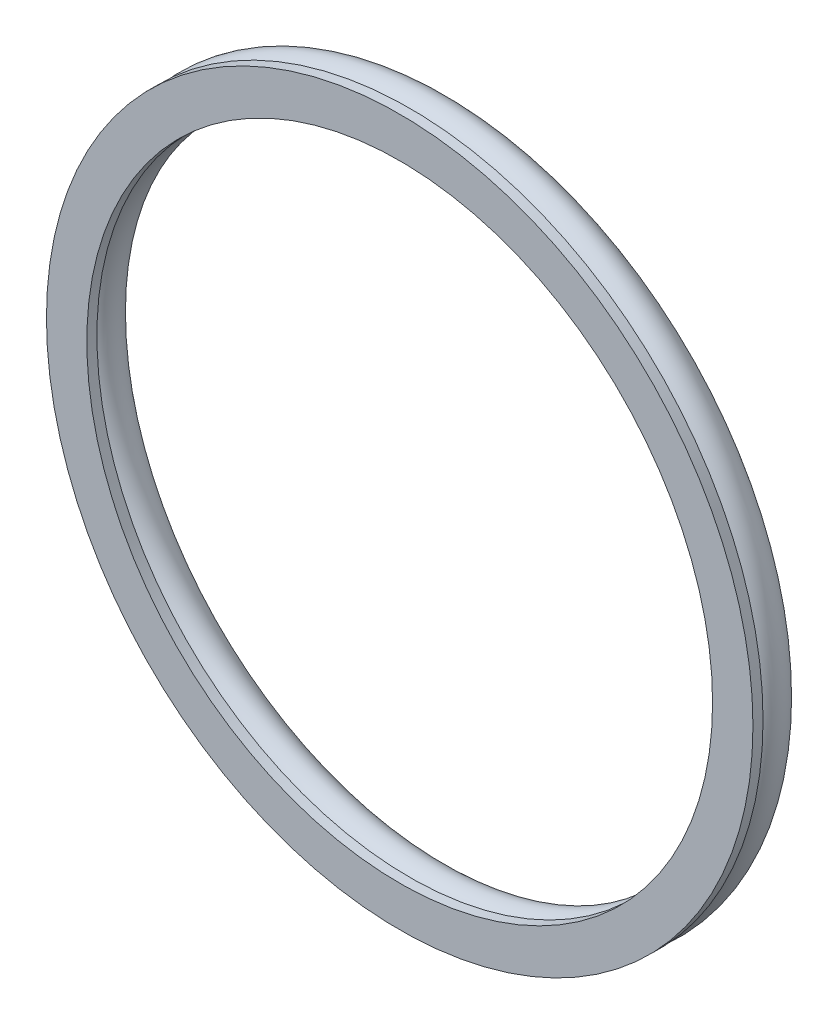
ISO-10303-21;
HEADER;
FILE_DESCRIPTION(('STEP AP214'),'2;1');
FILE_NAME('part.step','',(''),(''),'','','');
FILE_SCHEMA(('AUTOMOTIVE_DESIGN { 1 0 10303 214 1 1 1 1 }'));
ENDSEC;
DATA;
#1=APPLICATION_CONTEXT('core data for automotive mechanical design processes');
#2=APPLICATION_PROTOCOL_DEFINITION('international standard','automotive_design',2000,#1);
#3=PRODUCT_CONTEXT('',#1,'mechanical');
#4=PRODUCT('Part','Part','',(#3));
#5=PRODUCT_RELATED_PRODUCT_CATEGORY('part','',(#4));
#6=PRODUCT_DEFINITION_FORMATION('','',#4);
#7=PRODUCT_DEFINITION_CONTEXT('part definition',#1,'design');
#8=PRODUCT_DEFINITION('design','',#6,#7);
#9=PRODUCT_DEFINITION_SHAPE('','',#8);
#10=(LENGTH_UNIT() NAMED_UNIT(*) SI_UNIT(.MILLI.,.METRE.));
#11=(NAMED_UNIT(*) PLANE_ANGLE_UNIT() SI_UNIT($,.RADIAN.));
#12=(NAMED_UNIT(*) SI_UNIT($,.STERADIAN.) SOLID_ANGLE_UNIT());
#13=UNCERTAINTY_MEASURE_WITH_UNIT(LENGTH_MEASURE(1.E-05),#10,'distance_accuracy_value','');
#14=(GEOMETRIC_REPRESENTATION_CONTEXT(3) GLOBAL_UNCERTAINTY_ASSIGNED_CONTEXT((#13)) GLOBAL_UNIT_ASSIGNED_CONTEXT((#10,
#11,#12)) REPRESENTATION_CONTEXT('',''));
#15=CARTESIAN_POINT('',(0.,0.,0.));
#16=DIRECTION('',(0.,0.,1.));
#17=DIRECTION('',(1.,0.,0.));
#18=AXIS2_PLACEMENT_3D('',#15,#16,#17);
#19=CARTESIAN_POINT('',(0.,0.,15.));
#20=DIRECTION('',(0.,0.,1.));
#21=DIRECTION('',(1.,0.,0.));
#22=AXIS2_PLACEMENT_3D('',#19,#20,#21);
#23=PLANE('',#22);
#24=CARTESIAN_POINT('',(0.,0.,15.));
#25=DIRECTION('',(0.,0.,1.));
#26=DIRECTION('',(1.,0.,0.));
#27=AXIS2_PLACEMENT_3D('',#24,#25,#26);
#28=CIRCLE('',#27,175.);
#29=CARTESIAN_POINT('',(175.,0.,15.));
#30=VERTEX_POINT('',#29);
#31=EDGE_CURVE('E11',#30,#30,#28,.T.);
#32=ORIENTED_EDGE('',*,*,#31,.T.);
#33=EDGE_LOOP('',(#32));
#34=FACE_BOUND('',#33,.T.);
#35=CARTESIAN_POINT('',(0.,0.,15.));
#36=DIRECTION('',(0.,0.,1.));
#37=DIRECTION('',(1.,0.,0.));
#38=AXIS2_PLACEMENT_3D('',#35,#36,#37);
#39=CIRCLE('',#38,155.);
#40=CARTESIAN_POINT('',(155.,0.,15.));
#41=VERTEX_POINT('',#40);
#42=EDGE_CURVE('E52',#41,#41,#39,.T.);
#43=ORIENTED_EDGE('',*,*,#42,.F.);
#44=EDGE_LOOP('',(#43));
#45=FACE_BOUND('',#44,.T.);
#46=ADVANCED_FACE('F41',(#34,#45),#23,.T.);
#47=CARTESIAN_POINT('',(0.,0.,10.));
#48=DIRECTION('',(0.,0.,1.));
#49=DIRECTION('',(1.,0.,0.));
#50=AXIS2_PLACEMENT_3D('',#47,#48,#49);
#51=PLANE('',#50);
#52=CARTESIAN_POINT('',(0.,0.,10.));
#53=DIRECTION('',(0.,0.,1.));
#54=DIRECTION('',(1.,0.,0.));
#55=AXIS2_PLACEMENT_3D('',#52,#53,#54);
#56=CIRCLE('',#55,175.);
#57=CARTESIAN_POINT('',(175.,0.,10.));
#58=VERTEX_POINT('',#57);
#59=EDGE_CURVE('E45',#58,#58,#56,.T.);
#60=ORIENTED_EDGE('',*,*,#59,.F.);
#61=EDGE_LOOP('',(#60));
#62=FACE_BOUND('',#61,.T.);
#63=CARTESIAN_POINT('',(0.,0.,10.));
#64=DIRECTION('',(0.,0.,1.));
#65=DIRECTION('',(1.,0.,0.));
#66=AXIS2_PLACEMENT_3D('',#63,#64,#65);
#67=CIRCLE('',#66,155.);
#68=CARTESIAN_POINT('',(155.,0.,10.));
#69=VERTEX_POINT('',#68);
#70=EDGE_CURVE('E54',#69,#69,#67,.T.);
#71=ORIENTED_EDGE('',*,*,#70,.T.);
#72=EDGE_LOOP('',(#71));
#73=FACE_BOUND('',#72,.T.);
#74=ADVANCED_FACE('F64',(#62,#73),#51,.F.);
#75=CARTESIAN_POINT('',(0.,0.,15.));
#76=DIRECTION('',(0.,0.,-1.));
#77=DIRECTION('',(-1.,0.,0.));
#78=AXIS2_PLACEMENT_3D('',#75,#76,#77);
#79=CYLINDRICAL_SURFACE('',#78,175.);
#80=ORIENTED_EDGE('',*,*,#31,.F.);
#81=EDGE_LOOP('',(#80));
#82=FACE_BOUND('',#81,.T.);
#83=ORIENTED_EDGE('',*,*,#59,.T.);
#84=EDGE_LOOP('',(#83));
#85=FACE_BOUND('',#84,.T.);
#86=ADVANCED_FACE('F43',(#82,#85),#79,.T.);
#87=CARTESIAN_POINT('',(0.,0.,15.));
#88=DIRECTION('',(0.,0.,-1.));
#89=DIRECTION('',(-1.,0.,0.));
#90=AXIS2_PLACEMENT_3D('',#87,#88,#89);
#91=CYLINDRICAL_SURFACE('',#90,155.);
#92=ORIENTED_EDGE('',*,*,#42,.T.);
#93=EDGE_LOOP('',(#92));
#94=FACE_BOUND('',#93,.T.);
#95=ORIENTED_EDGE('',*,*,#70,.F.);
#96=EDGE_LOOP('',(#95));
#97=FACE_BOUND('',#96,.T.);
#98=ADVANCED_FACE('F60',(#94,#97),#91,.F.);
#99=CLOSED_SHELL('',(#46,#74,#86,#98));
#100=MANIFOLD_SOLID_BREP('B2',#99);
#101=CARTESIAN_POINT('',(0.,0.,0.));
#102=DIRECTION('',(0.,0.,1.));
#103=DIRECTION('',(1.,0.,0.));
#104=AXIS2_PLACEMENT_3D('',#101,#102,#103);
#105=TOROIDAL_SURFACE('',#104,165.,10.);
#106=CARTESIAN_POINT('',(175.,0.,0.));
#107=VERTEX_POINT('',#106);
#108=VERTEX_LOOP('',#107);
#109=FACE_BOUND('',#108,.T.);
#110=ADVANCED_FACE('F102',(#109),#105,.T.);
#111=CLOSED_SHELL('',(#110));
#112=MANIFOLD_SOLID_BREP('B6',#111);
#113=ADVANCED_BREP_SHAPE_REPRESENTATION('',(#18,#100,#112),#14);
#114=SHAPE_DEFINITION_REPRESENTATION(#9,#113);
ENDSEC;
END-ISO-10303-21;
